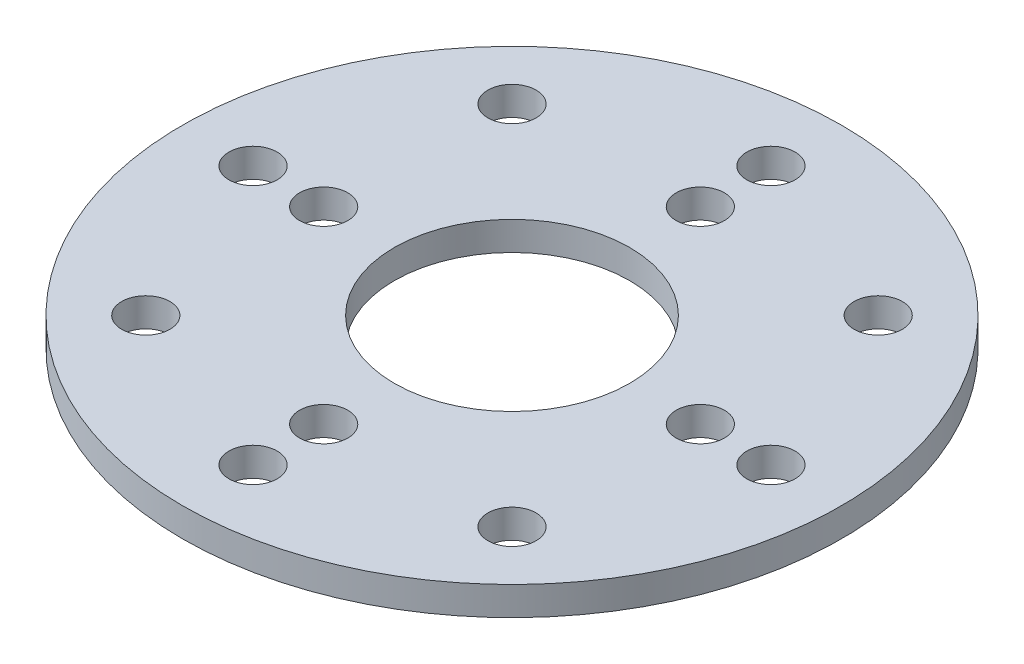
ISO-10303-21;
HEADER;
FILE_DESCRIPTION(('STEP AP214'),'2;1');
FILE_NAME('part.step','',(''),(''),'','','');
FILE_SCHEMA(('AUTOMOTIVE_DESIGN { 1 0 10303 214 1 1 1 1 }'));
ENDSEC;
DATA;
#1=APPLICATION_CONTEXT('core data for automotive mechanical design processes');
#2=APPLICATION_PROTOCOL_DEFINITION('international standard','automotive_design',2000,#1);
#3=PRODUCT_CONTEXT('',#1,'mechanical');
#4=PRODUCT('Part','Part','',(#3));
#5=PRODUCT_RELATED_PRODUCT_CATEGORY('part','',(#4));
#6=PRODUCT_DEFINITION_FORMATION('','',#4);
#7=PRODUCT_DEFINITION_CONTEXT('part definition',#1,'design');
#8=PRODUCT_DEFINITION('design','',#6,#7);
#9=PRODUCT_DEFINITION_SHAPE('','',#8);
#10=(LENGTH_UNIT() NAMED_UNIT(*) SI_UNIT(.MILLI.,.METRE.));
#11=(NAMED_UNIT(*) PLANE_ANGLE_UNIT() SI_UNIT($,.RADIAN.));
#12=(NAMED_UNIT(*) SI_UNIT($,.STERADIAN.) SOLID_ANGLE_UNIT());
#13=UNCERTAINTY_MEASURE_WITH_UNIT(LENGTH_MEASURE(1.E-05),#10,'distance_accuracy_value','');
#14=(GEOMETRIC_REPRESENTATION_CONTEXT(3) GLOBAL_UNCERTAINTY_ASSIGNED_CONTEXT((#13)) GLOBAL_UNIT_ASSIGNED_CONTEXT((#10,
#11,#12)) REPRESENTATION_CONTEXT('',''));
#15=CARTESIAN_POINT('',(0.,0.,0.));
#16=DIRECTION('',(0.,0.,1.));
#17=DIRECTION('',(1.,0.,0.));
#18=AXIS2_PLACEMENT_3D('',#15,#16,#17);
#19=CARTESIAN_POINT('',(0.,1.72,0.));
#20=DIRECTION('',(0.,-1.,0.));
#21=DIRECTION('',(0.,0.,-1.));
#22=AXIS2_PLACEMENT_3D('',#19,#20,#21);
#23=PLANE('',#22);
#24=CARTESIAN_POINT('',(-8.,1.72,0.));
#25=DIRECTION('',(0.,1.,0.));
#26=DIRECTION('',(0.,0.,1.));
#27=AXIS2_PLACEMENT_3D('',#24,#25,#26);
#28=CIRCLE('',#27,1.02499999999999);
#29=CARTESIAN_POINT('',(-8.,1.72,1.02499999999999));
#30=VERTEX_POINT('',#29);
#31=EDGE_CURVE('E81',#30,#30,#28,.F.);
#32=ORIENTED_EDGE('',*,*,#31,.T.);
#33=EDGE_LOOP('',(#32));
#34=FACE_BOUND('',#33,.T.);
#35=CARTESIAN_POINT('',(8.,1.72,0.));
#36=DIRECTION('',(0.,1.,0.));
#37=DIRECTION('',(0.,0.,1.));
#38=AXIS2_PLACEMENT_3D('',#35,#36,#37);
#39=CIRCLE('',#38,1.02499999999999);
#40=CARTESIAN_POINT('',(8.,1.72,1.02499999999999));
#41=VERTEX_POINT('',#40);
#42=EDGE_CURVE('E85',#41,#41,#39,.F.);
#43=ORIENTED_EDGE('',*,*,#42,.T.);
#44=EDGE_LOOP('',(#43));
#45=FACE_BOUND('',#44,.T.);
#46=CARTESIAN_POINT('',(-7.778174593052,1.72,-7.778174593052));
#47=DIRECTION('',(0.,1.,0.));
#48=DIRECTION('',(0.,0.,1.));
#49=AXIS2_PLACEMENT_3D('',#46,#47,#48);
#50=CIRCLE('',#49,1.02499999999999);
#51=CARTESIAN_POINT('',(-7.778174593052,1.72,-6.75317459305201));
#52=VERTEX_POINT('',#51);
#53=EDGE_CURVE('E89',#52,#52,#50,.F.);
#54=ORIENTED_EDGE('',*,*,#53,.T.);
#55=EDGE_LOOP('',(#54));
#56=FACE_BOUND('',#55,.T.);
#57=CARTESIAN_POINT('',(-7.778174593052,1.72,7.778174593052));
#58=DIRECTION('',(0.,1.,0.));
#59=DIRECTION('',(0.,0.,1.));
#60=AXIS2_PLACEMENT_3D('',#57,#58,#59);
#61=CIRCLE('',#60,1.02499999999999);
#62=CARTESIAN_POINT('',(-7.778174593052,1.72,8.80317459305199));
#63=VERTEX_POINT('',#62);
#64=EDGE_CURVE('E93',#63,#63,#61,.F.);
#65=ORIENTED_EDGE('',*,*,#64,.T.);
#66=EDGE_LOOP('',(#65));
#67=FACE_BOUND('',#66,.T.);
#68=CARTESIAN_POINT('',(7.778174593052,1.72,7.778174593052));
#69=DIRECTION('',(0.,1.,0.));
#70=DIRECTION('',(0.,0.,1.));
#71=AXIS2_PLACEMENT_3D('',#68,#69,#70);
#72=CIRCLE('',#71,1.02499999999999);
#73=CARTESIAN_POINT('',(7.778174593052,1.72,8.80317459305199));
#74=VERTEX_POINT('',#73);
#75=EDGE_CURVE('E97',#74,#74,#72,.F.);
#76=ORIENTED_EDGE('',*,*,#75,.T.);
#77=EDGE_LOOP('',(#76));
#78=FACE_BOUND('',#77,.T.);
#79=CARTESIAN_POINT('',(7.778174593052,1.72,-7.778174593052));
#80=DIRECTION('',(0.,1.,0.));
#81=DIRECTION('',(0.,0.,1.));
#82=AXIS2_PLACEMENT_3D('',#79,#80,#81);
#83=CIRCLE('',#82,1.02499999999999);
#84=CARTESIAN_POINT('',(7.778174593052,1.72,-6.75317459305201));
#85=VERTEX_POINT('',#84);
#86=EDGE_CURVE('E101',#85,#85,#83,.F.);
#87=ORIENTED_EDGE('',*,*,#86,.T.);
#88=EDGE_LOOP('',(#87));
#89=FACE_BOUND('',#88,.T.);
#90=CARTESIAN_POINT('',(0.,1.72,-11.));
#91=DIRECTION('',(0.,1.,0.));
#92=DIRECTION('',(0.,0.,1.));
#93=AXIS2_PLACEMENT_3D('',#90,#91,#92);
#94=CIRCLE('',#93,1.02499999999999);
#95=CARTESIAN_POINT('',(0.,1.72,-9.97500000000001));
#96=VERTEX_POINT('',#95);
#97=EDGE_CURVE('E105',#96,#96,#94,.F.);
#98=ORIENTED_EDGE('',*,*,#97,.T.);
#99=EDGE_LOOP('',(#98));
#100=FACE_BOUND('',#99,.T.);
#101=CARTESIAN_POINT('',(11.,1.72,0.));
#102=DIRECTION('',(0.,1.,0.));
#103=DIRECTION('',(0.,0.,1.));
#104=AXIS2_PLACEMENT_3D('',#101,#102,#103);
#105=CIRCLE('',#104,1.02499999999999);
#106=CARTESIAN_POINT('',(11.,1.72,1.02499999999999));
#107=VERTEX_POINT('',#106);
#108=EDGE_CURVE('E109',#107,#107,#105,.F.);
#109=ORIENTED_EDGE('',*,*,#108,.T.);
#110=EDGE_LOOP('',(#109));
#111=FACE_BOUND('',#110,.T.);
#112=CARTESIAN_POINT('',(0.,1.72,11.));
#113=DIRECTION('',(0.,1.,0.));
#114=DIRECTION('',(0.,0.,1.));
#115=AXIS2_PLACEMENT_3D('',#112,#113,#114);
#116=CIRCLE('',#115,1.02499999999999);
#117=CARTESIAN_POINT('',(0.,1.72,12.025));
#118=VERTEX_POINT('',#117);
#119=EDGE_CURVE('E113',#118,#118,#116,.F.);
#120=ORIENTED_EDGE('',*,*,#119,.T.);
#121=EDGE_LOOP('',(#120));
#122=FACE_BOUND('',#121,.T.);
#123=CARTESIAN_POINT('',(-11.,1.72,0.));
#124=DIRECTION('',(0.,1.,0.));
#125=DIRECTION('',(0.,0.,1.));
#126=AXIS2_PLACEMENT_3D('',#123,#124,#125);
#127=CIRCLE('',#126,1.02499999999999);
#128=CARTESIAN_POINT('',(-11.,1.72,1.02499999999999));
#129=VERTEX_POINT('',#128);
#130=EDGE_CURVE('E117',#129,#129,#127,.F.);
#131=ORIENTED_EDGE('',*,*,#130,.T.);
#132=EDGE_LOOP('',(#131));
#133=FACE_BOUND('',#132,.T.);
#134=CARTESIAN_POINT('',(0.,1.72,-8.));
#135=DIRECTION('',(0.,1.,0.));
#136=DIRECTION('',(0.,0.,1.));
#137=AXIS2_PLACEMENT_3D('',#134,#135,#136);
#138=CIRCLE('',#137,1.02499999999999);
#139=CARTESIAN_POINT('',(0.,1.72,-6.97500000000001));
#140=VERTEX_POINT('',#139);
#141=EDGE_CURVE('E121',#140,#140,#138,.F.);
#142=ORIENTED_EDGE('',*,*,#141,.T.);
#143=EDGE_LOOP('',(#142));
#144=FACE_BOUND('',#143,.T.);
#145=CARTESIAN_POINT('',(0.,1.72,8.));
#146=DIRECTION('',(0.,1.,0.));
#147=DIRECTION('',(0.,0.,1.));
#148=AXIS2_PLACEMENT_3D('',#145,#146,#147);
#149=CIRCLE('',#148,1.02499999999999);
#150=CARTESIAN_POINT('',(0.,1.72,9.02499999999999));
#151=VERTEX_POINT('',#150);
#152=EDGE_CURVE('E125',#151,#151,#149,.F.);
#153=ORIENTED_EDGE('',*,*,#152,.T.);
#154=EDGE_LOOP('',(#153));
#155=FACE_BOUND('',#154,.T.);
#156=CARTESIAN_POINT('',(0.,1.72,0.));
#157=DIRECTION('',(0.,-1.,0.));
#158=DIRECTION('',(0.,0.,-1.));
#159=AXIS2_PLACEMENT_3D('',#156,#157,#158);
#160=CIRCLE('',#159,14.);
#161=CARTESIAN_POINT('',(0.,1.72,-14.));
#162=VERTEX_POINT('',#161);
#163=EDGE_CURVE('E128',#162,#162,#160,.T.);
#164=ORIENTED_EDGE('',*,*,#163,.F.);
#165=EDGE_LOOP('',(#164));
#166=FACE_BOUND('',#165,.T.);
#167=CARTESIAN_POINT('',(0.,1.72,0.));
#168=DIRECTION('',(0.,1.,0.));
#169=DIRECTION('',(0.,0.,1.));
#170=AXIS2_PLACEMENT_3D('',#167,#168,#169);
#171=CIRCLE('',#170,5.);
#172=CARTESIAN_POINT('',(0.,1.72,5.));
#173=VERTEX_POINT('',#172);
#174=EDGE_CURVE('E20',#173,#173,#171,.F.);
#175=ORIENTED_EDGE('',*,*,#174,.T.);
#176=EDGE_LOOP('',(#175));
#177=FACE_BOUND('',#176,.T.);
#178=ADVANCED_FACE('F17',(#34,#45,#56,#67,#78,#89,#100,#111,#122,#133,#144,#155,#166,#177),#23,.F.);
#179=CARTESIAN_POINT('',(0.,0.5,0.));
#180=DIRECTION('',(0.,1.,0.));
#181=DIRECTION('',(0.,0.,1.));
#182=AXIS2_PLACEMENT_3D('',#179,#180,#181);
#183=CYLINDRICAL_SURFACE('',#182,5.);
#184=CARTESIAN_POINT('',(0.,0.5,0.));
#185=DIRECTION('',(0.,1.,0.));
#186=DIRECTION('',(0.,0.,1.));
#187=AXIS2_PLACEMENT_3D('',#184,#185,#186);
#188=CIRCLE('',#187,5.);
#189=CARTESIAN_POINT('',(0.,0.5,5.));
#190=VERTEX_POINT('',#189);
#191=EDGE_CURVE('E77',#190,#190,#188,.F.);
#192=ORIENTED_EDGE('',*,*,#191,.T.);
#193=EDGE_LOOP('',(#192));
#194=FACE_BOUND('',#193,.T.);
#195=ORIENTED_EDGE('',*,*,#174,.F.);
#196=EDGE_LOOP('',(#195));
#197=FACE_BOUND('',#196,.T.);
#198=ADVANCED_FACE('F139',(#194,#197),#183,.F.);
#199=CARTESIAN_POINT('',(0.,4.565,0.));
#200=DIRECTION('',(0.,-1.,0.));
#201=DIRECTION('',(0.,0.,-1.));
#202=AXIS2_PLACEMENT_3D('',#199,#200,#201);
#203=CYLINDRICAL_SURFACE('',#202,14.);
#204=CARTESIAN_POINT('',(0.,0.5,0.));
#205=DIRECTION('',(0.,-1.,0.));
#206=DIRECTION('',(0.,0.,-1.));
#207=AXIS2_PLACEMENT_3D('',#204,#205,#206);
#208=CIRCLE('',#207,14.);
#209=CARTESIAN_POINT('',(0.,0.5,-14.));
#210=VERTEX_POINT('',#209);
#211=EDGE_CURVE('E73',#210,#210,#208,.F.);
#212=ORIENTED_EDGE('',*,*,#211,.T.);
#213=EDGE_LOOP('',(#212));
#214=FACE_BOUND('',#213,.T.);
#215=ORIENTED_EDGE('',*,*,#163,.T.);
#216=EDGE_LOOP('',(#215));
#217=FACE_BOUND('',#216,.T.);
#218=ADVANCED_FACE('F141',(#214,#217),#203,.T.);
#219=CARTESIAN_POINT('',(0.,2.5,8.));
#220=DIRECTION('',(0.,1.,0.));
#221=DIRECTION('',(0.,0.,1.));
#222=AXIS2_PLACEMENT_3D('',#219,#220,#221);
#223=CYLINDRICAL_SURFACE('',#222,1.02499999999999);
#224=ORIENTED_EDGE('',*,*,#152,.F.);
#225=EDGE_LOOP('',(#224));
#226=FACE_BOUND('',#225,.T.);
#227=CARTESIAN_POINT('',(0.,0.5,8.));
#228=DIRECTION('',(0.,1.,0.));
#229=DIRECTION('',(0.,0.,1.));
#230=AXIS2_PLACEMENT_3D('',#227,#228,#229);
#231=CIRCLE('',#230,1.02499999999999);
#232=CARTESIAN_POINT('',(0.,0.5,9.02499999999999));
#233=VERTEX_POINT('',#232);
#234=EDGE_CURVE('E69',#233,#233,#231,.F.);
#235=ORIENTED_EDGE('',*,*,#234,.T.);
#236=EDGE_LOOP('',(#235));
#237=FACE_BOUND('',#236,.T.);
#238=ADVANCED_FACE('F148',(#226,#237),#223,.F.);
#239=CARTESIAN_POINT('',(0.,2.5,-8.));
#240=DIRECTION('',(0.,1.,0.));
#241=DIRECTION('',(0.,0.,1.));
#242=AXIS2_PLACEMENT_3D('',#239,#240,#241);
#243=CYLINDRICAL_SURFACE('',#242,1.02499999999999);
#244=ORIENTED_EDGE('',*,*,#141,.F.);
#245=EDGE_LOOP('',(#244));
#246=FACE_BOUND('',#245,.T.);
#247=CARTESIAN_POINT('',(0.,0.5,-8.));
#248=DIRECTION('',(0.,1.,0.));
#249=DIRECTION('',(0.,0.,1.));
#250=AXIS2_PLACEMENT_3D('',#247,#248,#249);
#251=CIRCLE('',#250,1.02499999999999);
#252=CARTESIAN_POINT('',(0.,0.5,-6.97500000000001));
#253=VERTEX_POINT('',#252);
#254=EDGE_CURVE('E65',#253,#253,#251,.F.);
#255=ORIENTED_EDGE('',*,*,#254,.T.);
#256=EDGE_LOOP('',(#255));
#257=FACE_BOUND('',#256,.T.);
#258=ADVANCED_FACE('F199',(#246,#257),#243,.F.);
#259=CARTESIAN_POINT('',(-11.,2.5,0.));
#260=DIRECTION('',(0.,1.,0.));
#261=DIRECTION('',(0.,0.,1.));
#262=AXIS2_PLACEMENT_3D('',#259,#260,#261);
#263=CYLINDRICAL_SURFACE('',#262,1.02499999999999);
#264=ORIENTED_EDGE('',*,*,#130,.F.);
#265=EDGE_LOOP('',(#264));
#266=FACE_BOUND('',#265,.T.);
#267=CARTESIAN_POINT('',(-11.,0.5,0.));
#268=DIRECTION('',(0.,1.,0.));
#269=DIRECTION('',(0.,0.,1.));
#270=AXIS2_PLACEMENT_3D('',#267,#268,#269);
#271=CIRCLE('',#270,1.02499999999999);
#272=CARTESIAN_POINT('',(-11.,0.5,1.02499999999999));
#273=VERTEX_POINT('',#272);
#274=EDGE_CURVE('E61',#273,#273,#271,.F.);
#275=ORIENTED_EDGE('',*,*,#274,.T.);
#276=EDGE_LOOP('',(#275));
#277=FACE_BOUND('',#276,.T.);
#278=ADVANCED_FACE('F195',(#266,#277),#263,.F.);
#279=CARTESIAN_POINT('',(0.,2.5,11.));
#280=DIRECTION('',(0.,1.,0.));
#281=DIRECTION('',(0.,0.,1.));
#282=AXIS2_PLACEMENT_3D('',#279,#280,#281);
#283=CYLINDRICAL_SURFACE('',#282,1.02499999999999);
#284=ORIENTED_EDGE('',*,*,#119,.F.);
#285=EDGE_LOOP('',(#284));
#286=FACE_BOUND('',#285,.T.);
#287=CARTESIAN_POINT('',(0.,0.5,11.));
#288=DIRECTION('',(0.,1.,0.));
#289=DIRECTION('',(0.,0.,1.));
#290=AXIS2_PLACEMENT_3D('',#287,#288,#289);
#291=CIRCLE('',#290,1.02499999999999);
#292=CARTESIAN_POINT('',(0.,0.5,12.025));
#293=VERTEX_POINT('',#292);
#294=EDGE_CURVE('E57',#293,#293,#291,.F.);
#295=ORIENTED_EDGE('',*,*,#294,.T.);
#296=EDGE_LOOP('',(#295));
#297=FACE_BOUND('',#296,.T.);
#298=ADVANCED_FACE('F191',(#286,#297),#283,.F.);
#299=CARTESIAN_POINT('',(11.,2.5,0.));
#300=DIRECTION('',(0.,1.,0.));
#301=DIRECTION('',(0.,0.,1.));
#302=AXIS2_PLACEMENT_3D('',#299,#300,#301);
#303=CYLINDRICAL_SURFACE('',#302,1.02499999999999);
#304=ORIENTED_EDGE('',*,*,#108,.F.);
#305=EDGE_LOOP('',(#304));
#306=FACE_BOUND('',#305,.T.);
#307=CARTESIAN_POINT('',(11.,0.5,0.));
#308=DIRECTION('',(0.,1.,0.));
#309=DIRECTION('',(0.,0.,1.));
#310=AXIS2_PLACEMENT_3D('',#307,#308,#309);
#311=CIRCLE('',#310,1.02499999999999);
#312=CARTESIAN_POINT('',(11.,0.5,1.02499999999999));
#313=VERTEX_POINT('',#312);
#314=EDGE_CURVE('E53',#313,#313,#311,.F.);
#315=ORIENTED_EDGE('',*,*,#314,.T.);
#316=EDGE_LOOP('',(#315));
#317=FACE_BOUND('',#316,.T.);
#318=ADVANCED_FACE('F187',(#306,#317),#303,.F.);
#319=CARTESIAN_POINT('',(0.,2.5,-11.));
#320=DIRECTION('',(0.,1.,0.));
#321=DIRECTION('',(0.,0.,1.));
#322=AXIS2_PLACEMENT_3D('',#319,#320,#321);
#323=CYLINDRICAL_SURFACE('',#322,1.02499999999999);
#324=ORIENTED_EDGE('',*,*,#97,.F.);
#325=EDGE_LOOP('',(#324));
#326=FACE_BOUND('',#325,.T.);
#327=CARTESIAN_POINT('',(0.,0.5,-11.));
#328=DIRECTION('',(0.,1.,0.));
#329=DIRECTION('',(0.,0.,1.));
#330=AXIS2_PLACEMENT_3D('',#327,#328,#329);
#331=CIRCLE('',#330,1.02499999999999);
#332=CARTESIAN_POINT('',(0.,0.5,-9.97500000000001));
#333=VERTEX_POINT('',#332);
#334=EDGE_CURVE('E49',#333,#333,#331,.F.);
#335=ORIENTED_EDGE('',*,*,#334,.T.);
#336=EDGE_LOOP('',(#335));
#337=FACE_BOUND('',#336,.T.);
#338=ADVANCED_FACE('F183',(#326,#337),#323,.F.);
#339=CARTESIAN_POINT('',(7.778174593052,2.5,-7.778174593052));
#340=DIRECTION('',(0.,1.,0.));
#341=DIRECTION('',(0.,0.,1.));
#342=AXIS2_PLACEMENT_3D('',#339,#340,#341);
#343=CYLINDRICAL_SURFACE('',#342,1.02499999999999);
#344=ORIENTED_EDGE('',*,*,#86,.F.);
#345=EDGE_LOOP('',(#344));
#346=FACE_BOUND('',#345,.T.);
#347=CARTESIAN_POINT('',(7.778174593052,0.5,-7.778174593052));
#348=DIRECTION('',(0.,1.,0.));
#349=DIRECTION('',(0.,0.,1.));
#350=AXIS2_PLACEMENT_3D('',#347,#348,#349);
#351=CIRCLE('',#350,1.02499999999999);
#352=CARTESIAN_POINT('',(7.778174593052,0.5,-6.75317459305201));
#353=VERTEX_POINT('',#352);
#354=EDGE_CURVE('E45',#353,#353,#351,.F.);
#355=ORIENTED_EDGE('',*,*,#354,.T.);
#356=EDGE_LOOP('',(#355));
#357=FACE_BOUND('',#356,.T.);
#358=ADVANCED_FACE('F179',(#346,#357),#343,.F.);
#359=CARTESIAN_POINT('',(7.778174593052,2.5,7.778174593052));
#360=DIRECTION('',(0.,1.,0.));
#361=DIRECTION('',(0.,0.,1.));
#362=AXIS2_PLACEMENT_3D('',#359,#360,#361);
#363=CYLINDRICAL_SURFACE('',#362,1.02499999999999);
#364=ORIENTED_EDGE('',*,*,#75,.F.);
#365=EDGE_LOOP('',(#364));
#366=FACE_BOUND('',#365,.T.);
#367=CARTESIAN_POINT('',(7.778174593052,0.5,7.778174593052));
#368=DIRECTION('',(0.,1.,0.));
#369=DIRECTION('',(0.,0.,1.));
#370=AXIS2_PLACEMENT_3D('',#367,#368,#369);
#371=CIRCLE('',#370,1.02499999999999);
#372=CARTESIAN_POINT('',(7.778174593052,0.5,8.80317459305199));
#373=VERTEX_POINT('',#372);
#374=EDGE_CURVE('E41',#373,#373,#371,.F.);
#375=ORIENTED_EDGE('',*,*,#374,.T.);
#376=EDGE_LOOP('',(#375));
#377=FACE_BOUND('',#376,.T.);
#378=ADVANCED_FACE('F175',(#366,#377),#363,.F.);
#379=CARTESIAN_POINT('',(-7.778174593052,2.5,7.778174593052));
#380=DIRECTION('',(0.,1.,0.));
#381=DIRECTION('',(0.,0.,1.));
#382=AXIS2_PLACEMENT_3D('',#379,#380,#381);
#383=CYLINDRICAL_SURFACE('',#382,1.02499999999999);
#384=ORIENTED_EDGE('',*,*,#64,.F.);
#385=EDGE_LOOP('',(#384));
#386=FACE_BOUND('',#385,.T.);
#387=CARTESIAN_POINT('',(-7.778174593052,0.5,7.778174593052));
#388=DIRECTION('',(0.,1.,0.));
#389=DIRECTION('',(0.,0.,1.));
#390=AXIS2_PLACEMENT_3D('',#387,#388,#389);
#391=CIRCLE('',#390,1.02499999999999);
#392=CARTESIAN_POINT('',(-7.778174593052,0.5,8.80317459305199));
#393=VERTEX_POINT('',#392);
#394=EDGE_CURVE('E37',#393,#393,#391,.F.);
#395=ORIENTED_EDGE('',*,*,#394,.T.);
#396=EDGE_LOOP('',(#395));
#397=FACE_BOUND('',#396,.T.);
#398=ADVANCED_FACE('F171',(#386,#397),#383,.F.);
#399=CARTESIAN_POINT('',(-7.778174593052,2.5,-7.778174593052));
#400=DIRECTION('',(0.,1.,0.));
#401=DIRECTION('',(0.,0.,1.));
#402=AXIS2_PLACEMENT_3D('',#399,#400,#401);
#403=CYLINDRICAL_SURFACE('',#402,1.02499999999999);
#404=ORIENTED_EDGE('',*,*,#53,.F.);
#405=EDGE_LOOP('',(#404));
#406=FACE_BOUND('',#405,.T.);
#407=CARTESIAN_POINT('',(-7.778174593052,0.5,-7.778174593052));
#408=DIRECTION('',(0.,1.,0.));
#409=DIRECTION('',(0.,0.,1.));
#410=AXIS2_PLACEMENT_3D('',#407,#408,#409);
#411=CIRCLE('',#410,1.02499999999999);
#412=CARTESIAN_POINT('',(-7.778174593052,0.5,-6.75317459305201));
#413=VERTEX_POINT('',#412);
#414=EDGE_CURVE('E31',#413,#413,#411,.F.);
#415=ORIENTED_EDGE('',*,*,#414,.T.);
#416=EDGE_LOOP('',(#415));
#417=FACE_BOUND('',#416,.T.);
#418=ADVANCED_FACE('F167',(#406,#417),#403,.F.);
#419=CARTESIAN_POINT('',(8.,2.5,0.));
#420=DIRECTION('',(0.,1.,0.));
#421=DIRECTION('',(0.,0.,1.));
#422=AXIS2_PLACEMENT_3D('',#419,#420,#421);
#423=CYLINDRICAL_SURFACE('',#422,1.02499999999999);
#424=ORIENTED_EDGE('',*,*,#42,.F.);
#425=EDGE_LOOP('',(#424));
#426=FACE_BOUND('',#425,.T.);
#427=CARTESIAN_POINT('',(8.,0.5,0.));
#428=DIRECTION('',(0.,1.,0.));
#429=DIRECTION('',(0.,0.,1.));
#430=AXIS2_PLACEMENT_3D('',#427,#428,#429);
#431=CIRCLE('',#430,1.02499999999999);
#432=CARTESIAN_POINT('',(8.,0.5,1.02499999999999));
#433=VERTEX_POINT('',#432);
#434=EDGE_CURVE('E24',#433,#433,#431,.F.);
#435=ORIENTED_EDGE('',*,*,#434,.T.);
#436=EDGE_LOOP('',(#435));
#437=FACE_BOUND('',#436,.T.);
#438=ADVANCED_FACE('F160',(#426,#437),#423,.F.);
#439=CARTESIAN_POINT('',(-8.,2.5,0.));
#440=DIRECTION('',(0.,1.,0.));
#441=DIRECTION('',(0.,0.,1.));
#442=AXIS2_PLACEMENT_3D('',#439,#440,#441);
#443=CYLINDRICAL_SURFACE('',#442,1.02499999999999);
#444=ORIENTED_EDGE('',*,*,#31,.F.);
#445=EDGE_LOOP('',(#444));
#446=FACE_BOUND('',#445,.T.);
#447=CARTESIAN_POINT('',(-8.,0.5,0.));
#448=DIRECTION('',(0.,1.,0.));
#449=DIRECTION('',(0.,0.,1.));
#450=AXIS2_PLACEMENT_3D('',#447,#448,#449);
#451=CIRCLE('',#450,1.02499999999999);
#452=CARTESIAN_POINT('',(-8.,0.5,1.02499999999999));
#453=VERTEX_POINT('',#452);
#454=EDGE_CURVE('E10',#453,#453,#451,.F.);
#455=ORIENTED_EDGE('',*,*,#454,.T.);
#456=EDGE_LOOP('',(#455));
#457=FACE_BOUND('',#456,.T.);
#458=ADVANCED_FACE('F154',(#446,#457),#443,.F.);
#459=CARTESIAN_POINT('',(0.,0.5,0.));
#460=DIRECTION('',(0.,1.,0.));
#461=DIRECTION('',(0.,0.,1.));
#462=AXIS2_PLACEMENT_3D('',#459,#460,#461);
#463=PLANE('',#462);
#464=ORIENTED_EDGE('',*,*,#454,.F.);
#465=EDGE_LOOP('',(#464));
#466=FACE_BOUND('',#465,.T.);
#467=ORIENTED_EDGE('',*,*,#434,.F.);
#468=EDGE_LOOP('',(#467));
#469=FACE_BOUND('',#468,.T.);
#470=ORIENTED_EDGE('',*,*,#414,.F.);
#471=EDGE_LOOP('',(#470));
#472=FACE_BOUND('',#471,.T.);
#473=ORIENTED_EDGE('',*,*,#394,.F.);
#474=EDGE_LOOP('',(#473));
#475=FACE_BOUND('',#474,.T.);
#476=ORIENTED_EDGE('',*,*,#374,.F.);
#477=EDGE_LOOP('',(#476));
#478=FACE_BOUND('',#477,.T.);
#479=ORIENTED_EDGE('',*,*,#354,.F.);
#480=EDGE_LOOP('',(#479));
#481=FACE_BOUND('',#480,.T.);
#482=ORIENTED_EDGE('',*,*,#334,.F.);
#483=EDGE_LOOP('',(#482));
#484=FACE_BOUND('',#483,.T.);
#485=ORIENTED_EDGE('',*,*,#314,.F.);
#486=EDGE_LOOP('',(#485));
#487=FACE_BOUND('',#486,.T.);
#488=ORIENTED_EDGE('',*,*,#294,.F.);
#489=EDGE_LOOP('',(#488));
#490=FACE_BOUND('',#489,.T.);
#491=ORIENTED_EDGE('',*,*,#274,.F.);
#492=EDGE_LOOP('',(#491));
#493=FACE_BOUND('',#492,.T.);
#494=ORIENTED_EDGE('',*,*,#254,.F.);
#495=EDGE_LOOP('',(#494));
#496=FACE_BOUND('',#495,.T.);
#497=ORIENTED_EDGE('',*,*,#234,.F.);
#498=EDGE_LOOP('',(#497));
#499=FACE_BOUND('',#498,.T.);
#500=ORIENTED_EDGE('',*,*,#211,.F.);
#501=EDGE_LOOP('',(#500));
#502=FACE_BOUND('',#501,.T.);
#503=ORIENTED_EDGE('',*,*,#191,.F.);
#504=EDGE_LOOP('',(#503));
#505=FACE_BOUND('',#504,.T.);
#506=ADVANCED_FACE('F152',(#466,#469,#472,#475,#478,#481,#484,#487,#490,#493,#496,#499,#502,
#505),#463,.F.);
#507=CLOSED_SHELL('',(#178,#198,#218,#238,#258,#278,#298,#318,#338,#358,#378,#398,#418,#438,
#458,#506));
#508=MANIFOLD_SOLID_BREP('B1',#507);
#509=ADVANCED_BREP_SHAPE_REPRESENTATION('',(#18,#508),#14);
#510=SHAPE_DEFINITION_REPRESENTATION(#9,#509);
ENDSEC;
END-ISO-10303-21;
